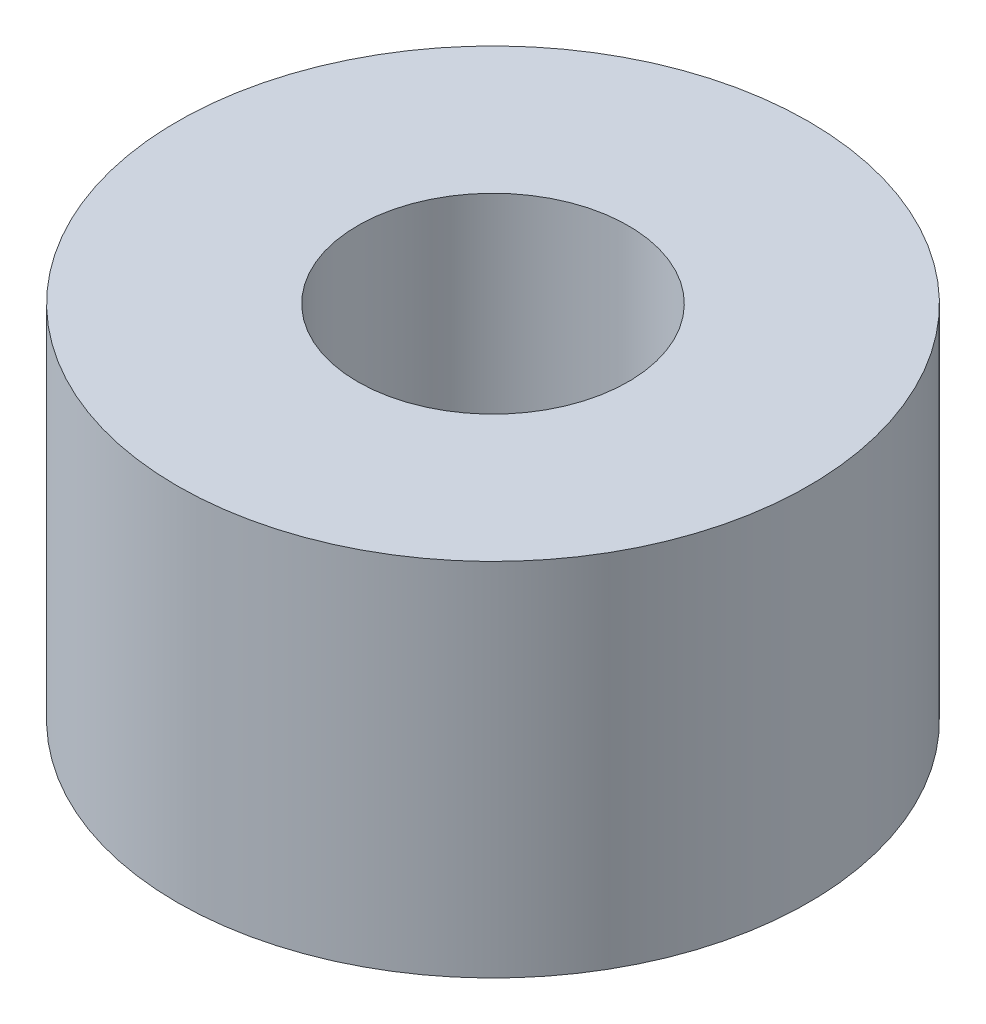
ISO-10303-21;
HEADER;
FILE_DESCRIPTION(('STEP AP214'),'2;1');
FILE_NAME('part.step','',(''),(''),'','','');
FILE_SCHEMA(('AUTOMOTIVE_DESIGN { 1 0 10303 214 1 1 1 1 }'));
ENDSEC;
DATA;
#1=APPLICATION_CONTEXT('core data for automotive mechanical design processes');
#2=APPLICATION_PROTOCOL_DEFINITION('international standard','automotive_design',2000,#1);
#3=PRODUCT_CONTEXT('',#1,'mechanical');
#4=PRODUCT('Part','Part','',(#3));
#5=PRODUCT_RELATED_PRODUCT_CATEGORY('part','',(#4));
#6=PRODUCT_DEFINITION_FORMATION('','',#4);
#7=PRODUCT_DEFINITION_CONTEXT('part definition',#1,'design');
#8=PRODUCT_DEFINITION('design','',#6,#7);
#9=PRODUCT_DEFINITION_SHAPE('','',#8);
#10=(LENGTH_UNIT() NAMED_UNIT(*) SI_UNIT(.MILLI.,.METRE.));
#11=(NAMED_UNIT(*) PLANE_ANGLE_UNIT() SI_UNIT($,.RADIAN.));
#12=(NAMED_UNIT(*) SI_UNIT($,.STERADIAN.) SOLID_ANGLE_UNIT());
#13=UNCERTAINTY_MEASURE_WITH_UNIT(LENGTH_MEASURE(1.E-05),#10,'distance_accuracy_value','');
#14=(GEOMETRIC_REPRESENTATION_CONTEXT(3) GLOBAL_UNCERTAINTY_ASSIGNED_CONTEXT((#13)) GLOBAL_UNIT_ASSIGNED_CONTEXT((#10,
#11,#12)) REPRESENTATION_CONTEXT('',''));
#15=CARTESIAN_POINT('',(0.,0.,0.));
#16=DIRECTION('',(0.,0.,1.));
#17=DIRECTION('',(1.,0.,0.));
#18=AXIS2_PLACEMENT_3D('',#15,#16,#17);
#19=CARTESIAN_POINT('',(0.,4.,0.));
#20=DIRECTION('',(0.,1.,0.));
#21=DIRECTION('',(0.,0.,1.));
#22=AXIS2_PLACEMENT_3D('',#19,#20,#21);
#23=PLANE('',#22);
#24=CARTESIAN_POINT('',(0.,4.,0.));
#25=DIRECTION('',(0.,1.,0.));
#26=DIRECTION('',(0.,0.,1.));
#27=AXIS2_PLACEMENT_3D('',#24,#25,#26);
#28=CIRCLE('',#27,3.5);
#29=CARTESIAN_POINT('',(0.,4.,3.5));
#30=VERTEX_POINT('',#29);
#31=EDGE_CURVE('E10',#30,#30,#28,.T.);
#32=ORIENTED_EDGE('',*,*,#31,.T.);
#33=EDGE_LOOP('',(#32));
#34=FACE_BOUND('',#33,.T.);
#35=CARTESIAN_POINT('',(0.,4.,0.));
#36=DIRECTION('',(0.,1.,0.));
#37=DIRECTION('',(0.,0.,1.));
#38=AXIS2_PLACEMENT_3D('',#35,#36,#37);
#39=CIRCLE('',#38,1.5);
#40=CARTESIAN_POINT('',(0.,4.,1.5));
#41=VERTEX_POINT('',#40);
#42=EDGE_CURVE('E43',#41,#41,#39,.T.);
#43=ORIENTED_EDGE('',*,*,#42,.F.);
#44=EDGE_LOOP('',(#43));
#45=FACE_BOUND('',#44,.T.);
#46=ADVANCED_FACE('F32',(#34,#45),#23,.T.);
#47=CARTESIAN_POINT('',(0.,0.,0.));
#48=DIRECTION('',(0.,1.,0.));
#49=DIRECTION('',(0.,0.,1.));
#50=AXIS2_PLACEMENT_3D('',#47,#48,#49);
#51=PLANE('',#50);
#52=CARTESIAN_POINT('',(0.,0.,0.));
#53=DIRECTION('',(0.,1.,0.));
#54=DIRECTION('',(0.,0.,1.));
#55=AXIS2_PLACEMENT_3D('',#52,#53,#54);
#56=CIRCLE('',#55,3.5);
#57=CARTESIAN_POINT('',(0.,0.,3.5));
#58=VERTEX_POINT('',#57);
#59=EDGE_CURVE('E36',#58,#58,#56,.T.);
#60=ORIENTED_EDGE('',*,*,#59,.F.);
#61=EDGE_LOOP('',(#60));
#62=FACE_BOUND('',#61,.T.);
#63=CARTESIAN_POINT('',(0.,0.,0.));
#64=DIRECTION('',(0.,1.,0.));
#65=DIRECTION('',(0.,0.,1.));
#66=AXIS2_PLACEMENT_3D('',#63,#64,#65);
#67=CIRCLE('',#66,1.5);
#68=CARTESIAN_POINT('',(0.,0.,1.5));
#69=VERTEX_POINT('',#68);
#70=EDGE_CURVE('E45',#69,#69,#67,.T.);
#71=ORIENTED_EDGE('',*,*,#70,.T.);
#72=EDGE_LOOP('',(#71));
#73=FACE_BOUND('',#72,.T.);
#74=ADVANCED_FACE('F55',(#62,#73),#51,.F.);
#75=CARTESIAN_POINT('',(0.,4.,0.));
#76=DIRECTION('',(0.,-1.,0.));
#77=DIRECTION('',(0.,0.,-1.));
#78=AXIS2_PLACEMENT_3D('',#75,#76,#77);
#79=CYLINDRICAL_SURFACE('',#78,3.5);
#80=ORIENTED_EDGE('',*,*,#31,.F.);
#81=EDGE_LOOP('',(#80));
#82=FACE_BOUND('',#81,.T.);
#83=ORIENTED_EDGE('',*,*,#59,.T.);
#84=EDGE_LOOP('',(#83));
#85=FACE_BOUND('',#84,.T.);
#86=ADVANCED_FACE('F34',(#82,#85),#79,.T.);
#87=CARTESIAN_POINT('',(0.,4.,0.));
#88=DIRECTION('',(0.,-1.,0.));
#89=DIRECTION('',(0.,0.,-1.));
#90=AXIS2_PLACEMENT_3D('',#87,#88,#89);
#91=CYLINDRICAL_SURFACE('',#90,1.5);
#92=ORIENTED_EDGE('',*,*,#42,.T.);
#93=EDGE_LOOP('',(#92));
#94=FACE_BOUND('',#93,.T.);
#95=ORIENTED_EDGE('',*,*,#70,.F.);
#96=EDGE_LOOP('',(#95));
#97=FACE_BOUND('',#96,.T.);
#98=ADVANCED_FACE('F51',(#94,#97),#91,.F.);
#99=CLOSED_SHELL('',(#46,#74,#86,#98));
#100=MANIFOLD_SOLID_BREP('B2',#99);
#101=ADVANCED_BREP_SHAPE_REPRESENTATION('',(#18,#100),#14);
#102=SHAPE_DEFINITION_REPRESENTATION(#9,#101);
ENDSEC;
END-ISO-10303-21;
